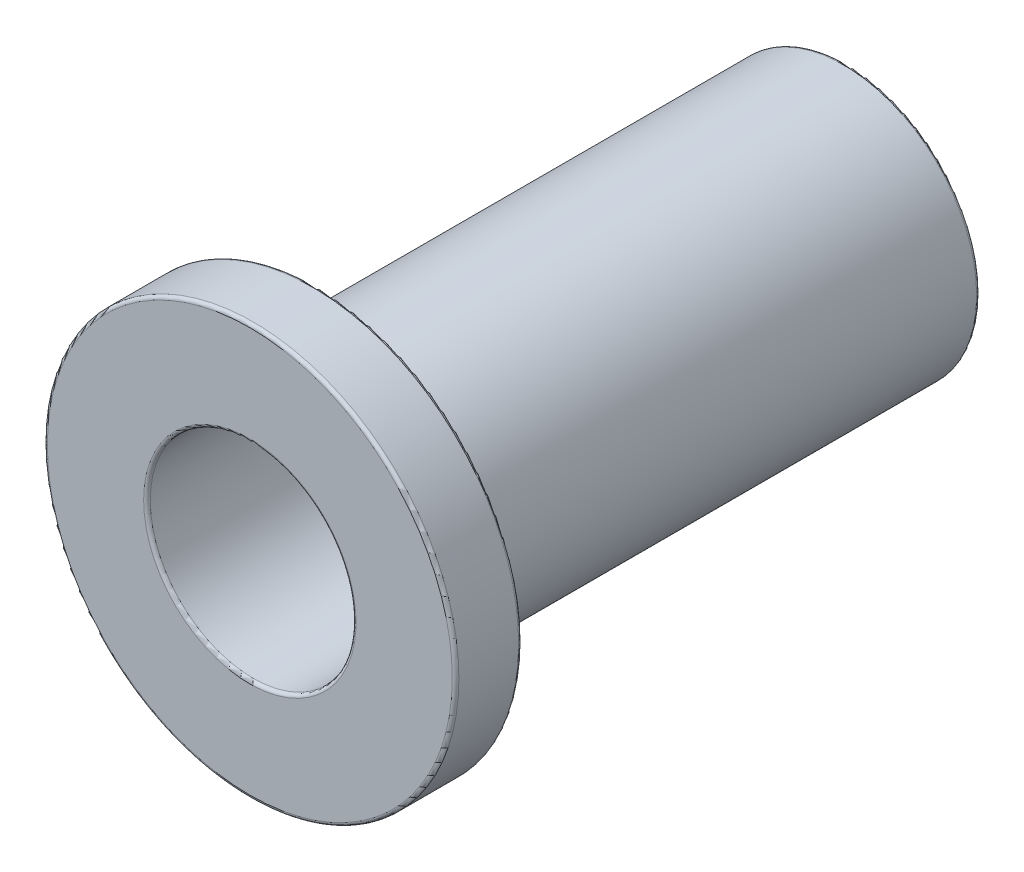
ISO-10303-21;
HEADER;
FILE_DESCRIPTION(('STEP AP214'),'2;1');
FILE_NAME('part.step','',(''),(''),'','','');
FILE_SCHEMA(('AUTOMOTIVE_DESIGN { 1 0 10303 214 1 1 1 1 }'));
ENDSEC;
DATA;
#1=APPLICATION_CONTEXT('core data for automotive mechanical design processes');
#2=APPLICATION_PROTOCOL_DEFINITION('international standard','automotive_design',2000,#1);
#3=PRODUCT_CONTEXT('',#1,'mechanical');
#4=PRODUCT('Part','Part','',(#3));
#5=PRODUCT_RELATED_PRODUCT_CATEGORY('part','',(#4));
#6=PRODUCT_DEFINITION_FORMATION('','',#4);
#7=PRODUCT_DEFINITION_CONTEXT('part definition',#1,'design');
#8=PRODUCT_DEFINITION('design','',#6,#7);
#9=PRODUCT_DEFINITION_SHAPE('','',#8);
#10=(LENGTH_UNIT() NAMED_UNIT(*) SI_UNIT(.MILLI.,.METRE.));
#11=(NAMED_UNIT(*) PLANE_ANGLE_UNIT() SI_UNIT($,.RADIAN.));
#12=(NAMED_UNIT(*) SI_UNIT($,.STERADIAN.) SOLID_ANGLE_UNIT());
#13=UNCERTAINTY_MEASURE_WITH_UNIT(LENGTH_MEASURE(1.E-05),#10,'distance_accuracy_value','');
#14=(GEOMETRIC_REPRESENTATION_CONTEXT(3) GLOBAL_UNCERTAINTY_ASSIGNED_CONTEXT((#13)) GLOBAL_UNIT_ASSIGNED_CONTEXT((#10,
#11,#12)) REPRESENTATION_CONTEXT('',''));
#15=CARTESIAN_POINT('',(0.,0.,0.));
#16=DIRECTION('',(0.,0.,1.));
#17=DIRECTION('',(1.,0.,0.));
#18=AXIS2_PLACEMENT_3D('',#15,#16,#17);
#19=CARTESIAN_POINT('',(0.,3.1,4.5));
#20=DIRECTION('',(0.,0.,-1.));
#21=DIRECTION('',(-1.,0.,0.));
#22=AXIS2_PLACEMENT_3D('',#19,#20,#21);
#23=PLANE('',#22);
#24=CARTESIAN_POINT('',(0.,0.,4.5));
#25=DIRECTION('',(0.,0.,-1.));
#26=DIRECTION('',(-1.,0.,0.));
#27=AXIS2_PLACEMENT_3D('',#24,#25,#26);
#28=CIRCLE('',#27,1.6);
#29=CARTESIAN_POINT('',(-1.6,0.,4.5));
#30=VERTEX_POINT('',#29);
#31=EDGE_CURVE('E69',#30,#30,#28,.T.);
#32=ORIENTED_EDGE('',*,*,#31,.T.);
#33=EDGE_LOOP('',(#32));
#34=FACE_BOUND('',#33,.T.);
#35=CARTESIAN_POINT('',(0.,0.,4.5));
#36=DIRECTION('',(0.,0.,-1.));
#37=DIRECTION('',(-1.,0.,0.));
#38=AXIS2_PLACEMENT_3D('',#35,#36,#37);
#39=CIRCLE('',#38,3.05);
#40=CARTESIAN_POINT('',(-3.05,0.,4.5));
#41=VERTEX_POINT('',#40);
#42=EDGE_CURVE('E72',#41,#41,#39,.F.);
#43=ORIENTED_EDGE('',*,*,#42,.T.);
#44=EDGE_LOOP('',(#43));
#45=FACE_BOUND('',#44,.T.);
#46=ADVANCED_FACE('F37',(#34,#45),#23,.F.);
#47=CARTESIAN_POINT('',(0.,0.,4.5));
#48=DIRECTION('',(0.,0.,1.));
#49=DIRECTION('',(1.,0.,0.));
#50=AXIS2_PLACEMENT_3D('',#47,#48,#49);
#51=CYLINDRICAL_SURFACE('',#50,1.55);
#52=CARTESIAN_POINT('',(0.,0.,4.45));
#53=DIRECTION('',(0.,0.,-1.));
#54=DIRECTION('',(-1.,0.,0.));
#55=AXIS2_PLACEMENT_3D('',#52,#53,#54);
#56=CIRCLE('',#55,1.55);
#57=CARTESIAN_POINT('',(-1.55,0.,4.45));
#58=VERTEX_POINT('',#57);
#59=EDGE_CURVE('E75',#58,#58,#56,.F.);
#60=ORIENTED_EDGE('',*,*,#59,.T.);
#61=EDGE_LOOP('',(#60));
#62=FACE_BOUND('',#61,.T.);
#63=CARTESIAN_POINT('',(0.,0.,-4.45));
#64=DIRECTION('',(0.,0.,1.));
#65=DIRECTION('',(1.,0.,0.));
#66=AXIS2_PLACEMENT_3D('',#63,#64,#65);
#67=CIRCLE('',#66,1.55);
#68=CARTESIAN_POINT('',(1.55,0.,-4.45));
#69=VERTEX_POINT('',#68);
#70=EDGE_CURVE('E78',#69,#69,#67,.F.);
#71=ORIENTED_EDGE('',*,*,#70,.T.);
#72=EDGE_LOOP('',(#71));
#73=FACE_BOUND('',#72,.T.);
#74=ADVANCED_FACE('F82',(#62,#73),#51,.F.);
#75=CARTESIAN_POINT('',(0.,1.55,-4.5));
#76=DIRECTION('',(0.,0.,1.));
#77=DIRECTION('',(1.,0.,0.));
#78=AXIS2_PLACEMENT_3D('',#75,#76,#77);
#79=PLANE('',#78);
#80=CARTESIAN_POINT('',(0.,0.,-4.5));
#81=DIRECTION('',(0.,0.,1.));
#82=DIRECTION('',(1.,0.,0.));
#83=AXIS2_PLACEMENT_3D('',#80,#81,#82);
#84=CIRCLE('',#83,1.6);
#85=CARTESIAN_POINT('',(1.6,0.,-4.5));
#86=VERTEX_POINT('',#85);
#87=EDGE_CURVE('E63',#86,#86,#84,.T.);
#88=ORIENTED_EDGE('',*,*,#87,.T.);
#89=EDGE_LOOP('',(#88));
#90=FACE_BOUND('',#89,.T.);
#91=CARTESIAN_POINT('',(0.,0.,-4.5));
#92=DIRECTION('',(0.,0.,1.));
#93=DIRECTION('',(1.,0.,0.));
#94=AXIS2_PLACEMENT_3D('',#91,#92,#93);
#95=CIRCLE('',#94,1.95);
#96=CARTESIAN_POINT('',(1.95,0.,-4.5));
#97=VERTEX_POINT('',#96);
#98=EDGE_CURVE('E66',#97,#97,#95,.F.);
#99=ORIENTED_EDGE('',*,*,#98,.T.);
#100=EDGE_LOOP('',(#99));
#101=FACE_BOUND('',#100,.T.);
#102=ADVANCED_FACE('F92',(#90,#101),#79,.F.);
#103=CARTESIAN_POINT('',(0.,0.,4.5));
#104=DIRECTION('',(0.,0.,1.));
#105=DIRECTION('',(1.,0.,0.));
#106=AXIS2_PLACEMENT_3D('',#103,#104,#105);
#107=CYLINDRICAL_SURFACE('',#106,2.);
#108=CARTESIAN_POINT('',(0.,0.,-4.45));
#109=DIRECTION('',(0.,0.,1.));
#110=DIRECTION('',(1.,0.,0.));
#111=AXIS2_PLACEMENT_3D('',#108,#109,#110);
#112=CIRCLE('',#111,2.);
#113=CARTESIAN_POINT('',(2.,0.,-4.45));
#114=VERTEX_POINT('',#113);
#115=EDGE_CURVE('E57',#114,#114,#112,.T.);
#116=ORIENTED_EDGE('',*,*,#115,.T.);
#117=EDGE_LOOP('',(#116));
#118=FACE_BOUND('',#117,.T.);
#119=CARTESIAN_POINT('',(0.,0.,3.45));
#120=DIRECTION('',(0.,0.,1.));
#121=DIRECTION('',(1.,0.,0.));
#122=AXIS2_PLACEMENT_3D('',#119,#120,#121);
#123=CIRCLE('',#122,2.);
#124=CARTESIAN_POINT('',(2.,0.,3.45));
#125=VERTEX_POINT('',#124);
#126=EDGE_CURVE('E60',#125,#125,#123,.F.);
#127=ORIENTED_EDGE('',*,*,#126,.T.);
#128=EDGE_LOOP('',(#127));
#129=FACE_BOUND('',#128,.T.);
#130=ADVANCED_FACE('F95',(#118,#129),#107,.T.);
#131=CARTESIAN_POINT('',(0.,2.,3.5));
#132=DIRECTION('',(0.,0.,1.));
#133=DIRECTION('',(1.,0.,0.));
#134=AXIS2_PLACEMENT_3D('',#131,#132,#133);
#135=PLANE('',#134);
#136=CARTESIAN_POINT('',(0.,0.,3.5));
#137=DIRECTION('',(0.,0.,1.));
#138=DIRECTION('',(1.,0.,0.));
#139=AXIS2_PLACEMENT_3D('',#136,#137,#138);
#140=CIRCLE('',#139,2.05);
#141=CARTESIAN_POINT('',(2.05,0.,3.5));
#142=VERTEX_POINT('',#141);
#143=EDGE_CURVE('E48',#142,#142,#140,.T.);
#144=ORIENTED_EDGE('',*,*,#143,.T.);
#145=EDGE_LOOP('',(#144));
#146=FACE_BOUND('',#145,.T.);
#147=CARTESIAN_POINT('',(0.,0.,3.5));
#148=DIRECTION('',(0.,0.,1.));
#149=DIRECTION('',(1.,0.,0.));
#150=AXIS2_PLACEMENT_3D('',#147,#148,#149);
#151=CIRCLE('',#150,3.05);
#152=CARTESIAN_POINT('',(3.05,0.,3.5));
#153=VERTEX_POINT('',#152);
#154=EDGE_CURVE('E52',#153,#153,#151,.F.);
#155=ORIENTED_EDGE('',*,*,#154,.T.);
#156=EDGE_LOOP('',(#155));
#157=FACE_BOUND('',#156,.T.);
#158=ADVANCED_FACE('F107',(#146,#157),#135,.F.);
#159=CARTESIAN_POINT('',(0.,0.,4.5));
#160=DIRECTION('',(0.,0.,1.));
#161=DIRECTION('',(1.,0.,0.));
#162=AXIS2_PLACEMENT_3D('',#159,#160,#161);
#163=CYLINDRICAL_SURFACE('',#162,3.1);
#164=CARTESIAN_POINT('',(0.,0.,3.55));
#165=DIRECTION('',(0.,0.,1.));
#166=DIRECTION('',(1.,0.,0.));
#167=AXIS2_PLACEMENT_3D('',#164,#165,#166);
#168=CIRCLE('',#167,3.1);
#169=CARTESIAN_POINT('',(3.1,0.,3.55));
#170=VERTEX_POINT('',#169);
#171=EDGE_CURVE('E10',#170,#170,#168,.T.);
#172=ORIENTED_EDGE('',*,*,#171,.T.);
#173=EDGE_LOOP('',(#172));
#174=FACE_BOUND('',#173,.T.);
#175=CARTESIAN_POINT('',(0.,0.,4.45));
#176=DIRECTION('',(0.,0.,-1.));
#177=DIRECTION('',(-1.,0.,0.));
#178=AXIS2_PLACEMENT_3D('',#175,#176,#177);
#179=CIRCLE('',#178,3.1);
#180=CARTESIAN_POINT('',(-3.1,0.,4.45));
#181=VERTEX_POINT('',#180);
#182=EDGE_CURVE('E44',#181,#181,#179,.T.);
#183=ORIENTED_EDGE('',*,*,#182,.T.);
#184=EDGE_LOOP('',(#183));
#185=FACE_BOUND('',#184,.T.);
#186=ADVANCED_FACE('F119',(#174,#185),#163,.T.);
#187=CARTESIAN_POINT('',(0.,0.,4.45));
#188=DIRECTION('',(0.,0.,-1.));
#189=DIRECTION('',(-1.,0.,0.));
#190=AXIS2_PLACEMENT_3D('',#187,#188,#189);
#191=TOROIDAL_SURFACE('',#190,1.6,0.05);
#192=ORIENTED_EDGE('',*,*,#31,.F.);
#193=EDGE_LOOP('',(#192));
#194=FACE_BOUND('',#193,.T.);
#195=ORIENTED_EDGE('',*,*,#59,.F.);
#196=EDGE_LOOP('',(#195));
#197=FACE_BOUND('',#196,.T.);
#198=ADVANCED_FACE('F88',(#194,#197),#191,.T.);
#199=CARTESIAN_POINT('',(0.,0.,-4.45));
#200=DIRECTION('',(0.,0.,1.));
#201=DIRECTION('',(1.,0.,0.));
#202=AXIS2_PLACEMENT_3D('',#199,#200,#201);
#203=TOROIDAL_SURFACE('',#202,1.6,0.05);
#204=ORIENTED_EDGE('',*,*,#70,.F.);
#205=EDGE_LOOP('',(#204));
#206=FACE_BOUND('',#205,.T.);
#207=ORIENTED_EDGE('',*,*,#87,.F.);
#208=EDGE_LOOP('',(#207));
#209=FACE_BOUND('',#208,.T.);
#210=ADVANCED_FACE('F84',(#206,#209),#203,.T.);
#211=CARTESIAN_POINT('',(0.,0.,-4.45));
#212=DIRECTION('',(0.,0.,1.));
#213=DIRECTION('',(1.,0.,0.));
#214=AXIS2_PLACEMENT_3D('',#211,#212,#213);
#215=TOROIDAL_SURFACE('',#214,1.95,0.05);
#216=ORIENTED_EDGE('',*,*,#98,.F.);
#217=EDGE_LOOP('',(#216));
#218=FACE_BOUND('',#217,.T.);
#219=ORIENTED_EDGE('',*,*,#115,.F.);
#220=EDGE_LOOP('',(#219));
#221=FACE_BOUND('',#220,.T.);
#222=ADVANCED_FACE('F87',(#218,#221),#215,.T.);
#223=CARTESIAN_POINT('',(0.,0.,3.45));
#224=DIRECTION('',(0.,0.,1.));
#225=DIRECTION('',(1.,0.,0.));
#226=AXIS2_PLACEMENT_3D('',#223,#224,#225);
#227=TOROIDAL_SURFACE('',#226,2.05,0.05);
#228=ORIENTED_EDGE('',*,*,#126,.F.);
#229=EDGE_LOOP('',(#228));
#230=FACE_BOUND('',#229,.T.);
#231=ORIENTED_EDGE('',*,*,#143,.F.);
#232=EDGE_LOOP('',(#231));
#233=FACE_BOUND('',#232,.T.);
#234=ADVANCED_FACE('F101',(#230,#233),#227,.F.);
#235=CARTESIAN_POINT('',(0.,0.,3.55));
#236=DIRECTION('',(0.,0.,1.));
#237=DIRECTION('',(1.,0.,0.));
#238=AXIS2_PLACEMENT_3D('',#235,#236,#237);
#239=TOROIDAL_SURFACE('',#238,3.05,0.05);
#240=ORIENTED_EDGE('',*,*,#154,.F.);
#241=EDGE_LOOP('',(#240));
#242=FACE_BOUND('',#241,.T.);
#243=ORIENTED_EDGE('',*,*,#171,.F.);
#244=EDGE_LOOP('',(#243));
#245=FACE_BOUND('',#244,.T.);
#246=ADVANCED_FACE('F113',(#242,#245),#239,.T.);
#247=CARTESIAN_POINT('',(0.,0.,4.45));
#248=DIRECTION('',(0.,0.,-1.));
#249=DIRECTION('',(-1.,0.,0.));
#250=AXIS2_PLACEMENT_3D('',#247,#248,#249);
#251=TOROIDAL_SURFACE('',#250,3.05,0.05);
#252=ORIENTED_EDGE('',*,*,#182,.F.);
#253=EDGE_LOOP('',(#252));
#254=FACE_BOUND('',#253,.T.);
#255=ORIENTED_EDGE('',*,*,#42,.F.);
#256=EDGE_LOOP('',(#255));
#257=FACE_BOUND('',#256,.T.);
#258=ADVANCED_FACE('F39',(#254,#257),#251,.T.);
#259=CLOSED_SHELL('',(#46,#74,#102,#130,#158,#186,#198,#210,#222,#234,#246,#258));
#260=MANIFOLD_SOLID_BREP('B2',#259);
#261=ADVANCED_BREP_SHAPE_REPRESENTATION('',(#18,#260),#14);
#262=SHAPE_DEFINITION_REPRESENTATION(#9,#261);
ENDSEC;
END-ISO-10303-21;
